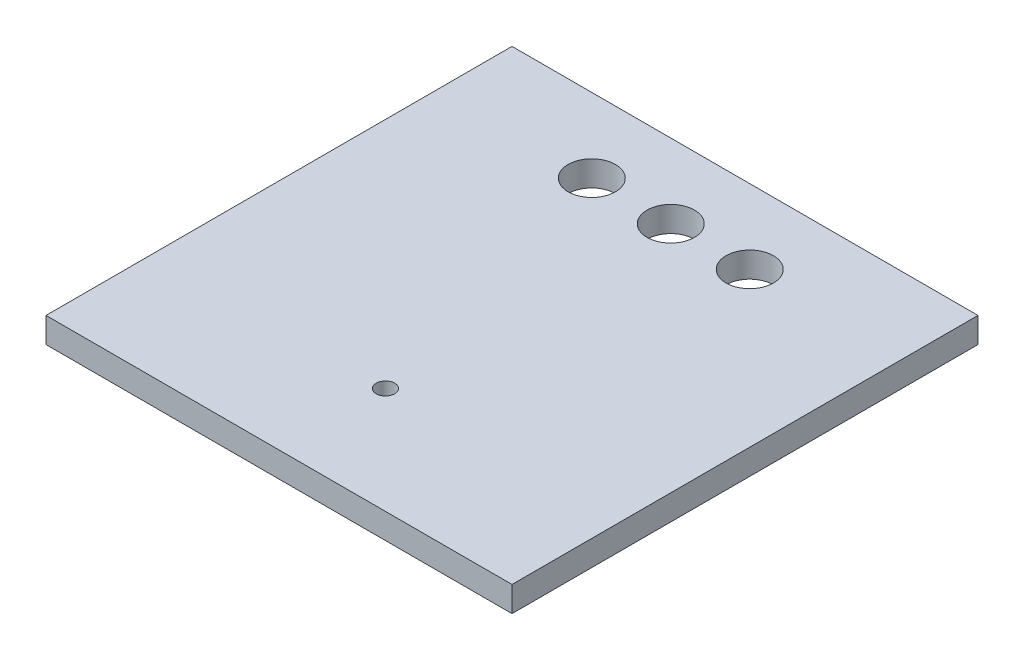
ISO-10303-21;
HEADER;
FILE_DESCRIPTION(('STEP AP214'),'2;1');
FILE_NAME('part.step','',(''),(''),'','','');
FILE_SCHEMA(('AUTOMOTIVE_DESIGN { 1 0 10303 214 1 1 1 1 }'));
ENDSEC;
DATA;
#1=APPLICATION_CONTEXT('core data for automotive mechanical design processes');
#2=APPLICATION_PROTOCOL_DEFINITION('international standard','automotive_design',2000,#1);
#3=PRODUCT_CONTEXT('',#1,'mechanical');
#4=PRODUCT('Part','Part','',(#3));
#5=PRODUCT_RELATED_PRODUCT_CATEGORY('part','',(#4));
#6=PRODUCT_DEFINITION_FORMATION('','',#4);
#7=PRODUCT_DEFINITION_CONTEXT('part definition',#1,'design');
#8=PRODUCT_DEFINITION('design','',#6,#7);
#9=PRODUCT_DEFINITION_SHAPE('','',#8);
#10=(LENGTH_UNIT() NAMED_UNIT(*) SI_UNIT(.MILLI.,.METRE.));
#11=(NAMED_UNIT(*) PLANE_ANGLE_UNIT() SI_UNIT($,.RADIAN.));
#12=(NAMED_UNIT(*) SI_UNIT($,.STERADIAN.) SOLID_ANGLE_UNIT());
#13=UNCERTAINTY_MEASURE_WITH_UNIT(LENGTH_MEASURE(1.E-05),#10,'distance_accuracy_value','');
#14=(GEOMETRIC_REPRESENTATION_CONTEXT(3) GLOBAL_UNCERTAINTY_ASSIGNED_CONTEXT((#13)) GLOBAL_UNIT_ASSIGNED_CONTEXT((#10,
#11,#12)) REPRESENTATION_CONTEXT('',''));
#15=CARTESIAN_POINT('',(0.,0.,0.));
#16=DIRECTION('',(0.,0.,1.));
#17=DIRECTION('',(1.,0.,0.));
#18=AXIS2_PLACEMENT_3D('',#15,#16,#17);
#19=CARTESIAN_POINT('',(7.49299999999999,0.8128,7.49300000000001));
#20=DIRECTION('',(-1.,0.,0.));
#21=DIRECTION('',(0.,0.,1.));
#22=AXIS2_PLACEMENT_3D('',#19,#20,#21);
#23=PLANE('',#22);
#24=DIRECTION('',(0.,0.,-1.));
#25=VECTOR('',#24,1.);
#26=CARTESIAN_POINT('',(7.49299999999999,0.,7.49300000000001));
#27=LINE('',#26,#25);
#28=CARTESIAN_POINT('',(7.49299999999999,0.,7.49300000000001));
#29=VERTEX_POINT('',#28);
#30=CARTESIAN_POINT('',(7.49299999999999,0.,-7.49299999999999));
#31=VERTEX_POINT('',#30);
#32=EDGE_CURVE('E98',#29,#31,#27,.T.);
#33=ORIENTED_EDGE('',*,*,#32,.T.);
#34=DIRECTION('',(0.,-1.,0.));
#35=VECTOR('',#34,1.);
#36=CARTESIAN_POINT('',(7.49299999999999,0.8128,-7.49299999999999));
#37=LINE('',#36,#35);
#38=CARTESIAN_POINT('',(7.49299999999999,0.8128,-7.49299999999999));
#39=VERTEX_POINT('',#38);
#40=EDGE_CURVE('E11',#39,#31,#37,.T.);
#41=ORIENTED_EDGE('',*,*,#40,.F.);
#42=DIRECTION('',(0.,0.,-1.));
#43=VECTOR('',#42,1.);
#44=CARTESIAN_POINT('',(7.49299999999999,0.8128,7.49300000000001));
#45=LINE('',#44,#43);
#46=CARTESIAN_POINT('',(7.49299999999999,0.8128,7.49300000000001));
#47=VERTEX_POINT('',#46);
#48=EDGE_CURVE('E85',#47,#39,#45,.T.);
#49=ORIENTED_EDGE('',*,*,#48,.F.);
#50=DIRECTION('',(0.,-1.,0.));
#51=VECTOR('',#50,1.);
#52=CARTESIAN_POINT('',(7.49299999999999,0.8128,7.49300000000001));
#53=LINE('',#52,#51);
#54=EDGE_CURVE('E94',#47,#29,#53,.T.);
#55=ORIENTED_EDGE('',*,*,#54,.T.);
#56=EDGE_LOOP('',(#33,#41,#49,#55));
#57=FACE_BOUND('',#56,.T.);
#58=ADVANCED_FACE('F32',(#57),#23,.F.);
#59=CARTESIAN_POINT('',(-7.49300000000001,0.8128,-7.49299999999999));
#60=DIRECTION('',(0.,0.,1.));
#61=DIRECTION('',(1.,0.,0.));
#62=AXIS2_PLACEMENT_3D('',#59,#60,#61);
#63=PLANE('',#62);
#64=DIRECTION('',(-1.,0.,0.));
#65=VECTOR('',#64,1.);
#66=CARTESIAN_POINT('',(-7.49300000000001,0.,-7.49299999999999));
#67=LINE('',#66,#65);
#68=CARTESIAN_POINT('',(-7.49300000000001,0.,-7.49299999999999));
#69=VERTEX_POINT('',#68);
#70=EDGE_CURVE('E89',#31,#69,#67,.T.);
#71=ORIENTED_EDGE('',*,*,#70,.T.);
#72=DIRECTION('',(0.,-1.,0.));
#73=VECTOR('',#72,1.);
#74=CARTESIAN_POINT('',(-7.49300000000001,0.8128,-7.49299999999999));
#75=LINE('',#74,#73);
#76=CARTESIAN_POINT('',(-7.49300000000001,0.8128,-7.49299999999999));
#77=VERTEX_POINT('',#76);
#78=EDGE_CURVE('E41',#77,#69,#75,.T.);
#79=ORIENTED_EDGE('',*,*,#78,.F.);
#80=DIRECTION('',(-1.,0.,0.));
#81=VECTOR('',#80,1.);
#82=CARTESIAN_POINT('',(-7.49300000000001,0.8128,-7.49299999999999));
#83=LINE('',#82,#81);
#84=EDGE_CURVE('E80',#39,#77,#83,.T.);
#85=ORIENTED_EDGE('',*,*,#84,.F.);
#86=ORIENTED_EDGE('',*,*,#40,.T.);
#87=EDGE_LOOP('',(#71,#79,#85,#86));
#88=FACE_BOUND('',#87,.T.);
#89=ADVANCED_FACE('F88',(#88),#63,.F.);
#90=CARTESIAN_POINT('',(-7.49300000000001,0.8128,7.49300000000001));
#91=DIRECTION('',(1.,0.,0.));
#92=DIRECTION('',(0.,0.,-1.));
#93=AXIS2_PLACEMENT_3D('',#90,#91,#92);
#94=PLANE('',#93);
#95=DIRECTION('',(0.,0.,1.));
#96=VECTOR('',#95,1.);
#97=CARTESIAN_POINT('',(-7.49300000000001,0.,7.49300000000001));
#98=LINE('',#97,#96);
#99=CARTESIAN_POINT('',(-7.49300000000001,0.,7.49300000000001));
#100=VERTEX_POINT('',#99);
#101=EDGE_CURVE('E67',#69,#100,#98,.T.);
#102=ORIENTED_EDGE('',*,*,#101,.T.);
#103=DIRECTION('',(0.,-1.,0.));
#104=VECTOR('',#103,1.);
#105=CARTESIAN_POINT('',(-7.49300000000001,0.8128,7.49300000000001));
#106=LINE('',#105,#104);
#107=CARTESIAN_POINT('',(-7.49300000000001,0.8128,7.49300000000001));
#108=VERTEX_POINT('',#107);
#109=EDGE_CURVE('E90',#108,#100,#106,.T.);
#110=ORIENTED_EDGE('',*,*,#109,.F.);
#111=DIRECTION('',(0.,0.,1.));
#112=VECTOR('',#111,1.);
#113=CARTESIAN_POINT('',(-7.49300000000001,0.8128,7.49300000000001));
#114=LINE('',#113,#112);
#115=EDGE_CURVE('E83',#77,#108,#114,.T.);
#116=ORIENTED_EDGE('',*,*,#115,.F.);
#117=ORIENTED_EDGE('',*,*,#78,.T.);
#118=EDGE_LOOP('',(#102,#110,#116,#117));
#119=FACE_BOUND('',#118,.T.);
#120=ADVANCED_FACE('F92',(#119),#94,.F.);
#121=CARTESIAN_POINT('',(-7.49300000000001,0.8128,7.49300000000001));
#122=DIRECTION('',(0.,0.,-1.));
#123=DIRECTION('',(-1.,0.,0.));
#124=AXIS2_PLACEMENT_3D('',#121,#122,#123);
#125=PLANE('',#124);
#126=DIRECTION('',(1.,0.,0.));
#127=VECTOR('',#126,1.);
#128=CARTESIAN_POINT('',(-7.49300000000001,0.,7.49300000000001));
#129=LINE('',#128,#127);
#130=EDGE_CURVE('E73',#100,#29,#129,.T.);
#131=ORIENTED_EDGE('',*,*,#130,.T.);
#132=ORIENTED_EDGE('',*,*,#54,.F.);
#133=DIRECTION('',(1.,0.,0.));
#134=VECTOR('',#133,1.);
#135=CARTESIAN_POINT('',(-7.49300000000001,0.8128,7.49300000000001));
#136=LINE('',#135,#134);
#137=EDGE_CURVE('E50',#108,#47,#136,.T.);
#138=ORIENTED_EDGE('',*,*,#137,.F.);
#139=ORIENTED_EDGE('',*,*,#109,.T.);
#140=EDGE_LOOP('',(#131,#132,#138,#139));
#141=FACE_BOUND('',#140,.T.);
#142=ADVANCED_FACE('F148',(#141),#125,.F.);
#143=CARTESIAN_POINT('',(0.,0.8128,0.));
#144=DIRECTION('',(0.,-1.,0.));
#145=DIRECTION('',(0.,0.,-1.));
#146=AXIS2_PLACEMENT_3D('',#143,#144,#145);
#147=PLANE('',#146);
#148=CARTESIAN_POINT('',(-2.54,0.8128,-5.10575447964992));
#149=DIRECTION('',(0.,-1.,0.));
#150=DIRECTION('',(0.,0.,-1.));
#151=AXIS2_PLACEMENT_3D('',#148,#149,#150);
#152=CIRCLE('',#151,0.762);
#153=CARTESIAN_POINT('',(-2.54,0.8128,-5.86775447964992));
#154=VERTEX_POINT('',#153);
#155=EDGE_CURVE('E101',#154,#154,#152,.T.);
#156=ORIENTED_EDGE('',*,*,#155,.T.);
#157=EDGE_LOOP('',(#156));
#158=FACE_BOUND('',#157,.T.);
#159=CARTESIAN_POINT('',(0.,0.8128,-5.10575447964992));
#160=DIRECTION('',(0.,-1.,0.));
#161=DIRECTION('',(0.,0.,-1.));
#162=AXIS2_PLACEMENT_3D('',#159,#160,#161);
#163=CIRCLE('',#162,0.762);
#164=CARTESIAN_POINT('',(0.,0.8128,-5.86775447964992));
#165=VERTEX_POINT('',#164);
#166=EDGE_CURVE('E116',#165,#165,#163,.T.);
#167=ORIENTED_EDGE('',*,*,#166,.T.);
#168=EDGE_LOOP('',(#167));
#169=FACE_BOUND('',#168,.T.);
#170=CARTESIAN_POINT('',(2.54,0.8128,-5.10575447964992));
#171=DIRECTION('',(0.,-1.,0.));
#172=DIRECTION('',(0.,0.,-1.));
#173=AXIS2_PLACEMENT_3D('',#170,#171,#172);
#174=CIRCLE('',#173,0.762);
#175=CARTESIAN_POINT('',(2.54,0.8128,-5.86775447964992));
#176=VERTEX_POINT('',#175);
#177=EDGE_CURVE('E113',#176,#176,#174,.T.);
#178=ORIENTED_EDGE('',*,*,#177,.T.);
#179=EDGE_LOOP('',(#178));
#180=FACE_BOUND('',#179,.T.);
#181=CARTESIAN_POINT('',(0.,0.8128,4.07020207700783));
#182=DIRECTION('',(0.,-1.,0.));
#183=DIRECTION('',(0.,0.,-1.));
#184=AXIS2_PLACEMENT_3D('',#181,#182,#183);
#185=CIRCLE('',#184,0.297244980669235);
#186=CARTESIAN_POINT('',(0.,0.8128,3.77295709633859));
#187=VERTEX_POINT('',#186);
#188=EDGE_CURVE('E110',#187,#187,#185,.T.);
#189=ORIENTED_EDGE('',*,*,#188,.T.);
#190=EDGE_LOOP('',(#189));
#191=FACE_BOUND('',#190,.T.);
#192=ORIENTED_EDGE('',*,*,#48,.T.);
#193=ORIENTED_EDGE('',*,*,#84,.T.);
#194=ORIENTED_EDGE('',*,*,#115,.T.);
#195=ORIENTED_EDGE('',*,*,#137,.T.);
#196=EDGE_LOOP('',(#192,#193,#194,#195));
#197=FACE_BOUND('',#196,.T.);
#198=ADVANCED_FACE('F81',(#158,#169,#180,#191,#197),#147,.F.);
#199=CARTESIAN_POINT('',(0.,0.,0.));
#200=DIRECTION('',(0.,-1.,0.));
#201=DIRECTION('',(0.,0.,-1.));
#202=AXIS2_PLACEMENT_3D('',#199,#200,#201);
#203=PLANE('',#202);
#204=CARTESIAN_POINT('',(-2.54,0.,-5.10575447964992));
#205=DIRECTION('',(0.,-1.,0.));
#206=DIRECTION('',(0.,0.,-1.));
#207=AXIS2_PLACEMENT_3D('',#204,#205,#206);
#208=CIRCLE('',#207,0.762);
#209=CARTESIAN_POINT('',(-2.54,0.,-5.86775447964992));
#210=VERTEX_POINT('',#209);
#211=EDGE_CURVE('E35',#210,#210,#208,.T.);
#212=ORIENTED_EDGE('',*,*,#211,.F.);
#213=EDGE_LOOP('',(#212));
#214=FACE_BOUND('',#213,.T.);
#215=CARTESIAN_POINT('',(0.,0.,-5.10575447964992));
#216=DIRECTION('',(0.,-1.,0.));
#217=DIRECTION('',(0.,0.,-1.));
#218=AXIS2_PLACEMENT_3D('',#215,#216,#217);
#219=CIRCLE('',#218,0.762);
#220=CARTESIAN_POINT('',(0.,0.,-5.86775447964992));
#221=VERTEX_POINT('',#220);
#222=EDGE_CURVE('E114',#221,#221,#219,.T.);
#223=ORIENTED_EDGE('',*,*,#222,.F.);
#224=EDGE_LOOP('',(#223));
#225=FACE_BOUND('',#224,.T.);
#226=CARTESIAN_POINT('',(2.54,0.,-5.10575447964992));
#227=DIRECTION('',(0.,-1.,0.));
#228=DIRECTION('',(0.,0.,-1.));
#229=AXIS2_PLACEMENT_3D('',#226,#227,#228);
#230=CIRCLE('',#229,0.762);
#231=CARTESIAN_POINT('',(2.54,0.,-5.86775447964992));
#232=VERTEX_POINT('',#231);
#233=EDGE_CURVE('E111',#232,#232,#230,.T.);
#234=ORIENTED_EDGE('',*,*,#233,.F.);
#235=EDGE_LOOP('',(#234));
#236=FACE_BOUND('',#235,.T.);
#237=CARTESIAN_POINT('',(0.,0.,4.07020207700783));
#238=DIRECTION('',(0.,-1.,0.));
#239=DIRECTION('',(0.,0.,-1.));
#240=AXIS2_PLACEMENT_3D('',#237,#238,#239);
#241=CIRCLE('',#240,0.297244980669235);
#242=CARTESIAN_POINT('',(0.,0.,3.77295709633859));
#243=VERTEX_POINT('',#242);
#244=EDGE_CURVE('E107',#243,#243,#241,.T.);
#245=ORIENTED_EDGE('',*,*,#244,.F.);
#246=EDGE_LOOP('',(#245));
#247=FACE_BOUND('',#246,.T.);
#248=ORIENTED_EDGE('',*,*,#32,.F.);
#249=ORIENTED_EDGE('',*,*,#130,.F.);
#250=ORIENTED_EDGE('',*,*,#101,.F.);
#251=ORIENTED_EDGE('',*,*,#70,.F.);
#252=EDGE_LOOP('',(#248,#249,#250,#251));
#253=FACE_BOUND('',#252,.T.);
#254=ADVANCED_FACE('F136',(#214,#225,#236,#247,#253),#203,.T.);
#255=CARTESIAN_POINT('',(0.,-5.8928,4.07020207700783));
#256=DIRECTION('',(0.,1.,0.));
#257=DIRECTION('',(0.,0.,1.));
#258=AXIS2_PLACEMENT_3D('',#255,#256,#257);
#259=CYLINDRICAL_SURFACE('',#258,0.297244980669235);
#260=ORIENTED_EDGE('',*,*,#244,.T.);
#261=EDGE_LOOP('',(#260));
#262=FACE_BOUND('',#261,.T.);
#263=ORIENTED_EDGE('',*,*,#188,.F.);
#264=EDGE_LOOP('',(#263));
#265=FACE_BOUND('',#264,.T.);
#266=ADVANCED_FACE('F139',(#262,#265),#259,.F.);
#267=CARTESIAN_POINT('',(2.54,-5.8928,-5.10575447964992));
#268=DIRECTION('',(0.,1.,0.));
#269=DIRECTION('',(0.,0.,1.));
#270=AXIS2_PLACEMENT_3D('',#267,#268,#269);
#271=CYLINDRICAL_SURFACE('',#270,0.762);
#272=ORIENTED_EDGE('',*,*,#233,.T.);
#273=EDGE_LOOP('',(#272));
#274=FACE_BOUND('',#273,.T.);
#275=ORIENTED_EDGE('',*,*,#177,.F.);
#276=EDGE_LOOP('',(#275));
#277=FACE_BOUND('',#276,.T.);
#278=ADVANCED_FACE('F192',(#274,#277),#271,.F.);
#279=CARTESIAN_POINT('',(0.,-5.8928,-5.10575447964992));
#280=DIRECTION('',(0.,1.,0.));
#281=DIRECTION('',(0.,0.,1.));
#282=AXIS2_PLACEMENT_3D('',#279,#280,#281);
#283=CYLINDRICAL_SURFACE('',#282,0.762);
#284=ORIENTED_EDGE('',*,*,#222,.T.);
#285=EDGE_LOOP('',(#284));
#286=FACE_BOUND('',#285,.T.);
#287=ORIENTED_EDGE('',*,*,#166,.F.);
#288=EDGE_LOOP('',(#287));
#289=FACE_BOUND('',#288,.T.);
#290=ADVANCED_FACE('F202',(#286,#289),#283,.F.);
#291=CARTESIAN_POINT('',(-2.54,-5.8928,-5.10575447964992));
#292=DIRECTION('',(0.,1.,0.));
#293=DIRECTION('',(0.,0.,1.));
#294=AXIS2_PLACEMENT_3D('',#291,#292,#293);
#295=CYLINDRICAL_SURFACE('',#294,0.762);
#296=ORIENTED_EDGE('',*,*,#211,.T.);
#297=EDGE_LOOP('',(#296));
#298=FACE_BOUND('',#297,.T.);
#299=ORIENTED_EDGE('',*,*,#155,.F.);
#300=EDGE_LOOP('',(#299));
#301=FACE_BOUND('',#300,.T.);
#302=ADVANCED_FACE('F133',(#298,#301),#295,.F.);
#303=CLOSED_SHELL('',(#58,#89,#120,#142,#198,#254,#266,#278,#290,#302));
#304=MANIFOLD_SOLID_BREP('B2',#303);
#305=ADVANCED_BREP_SHAPE_REPRESENTATION('',(#18,#304),#14);
#306=SHAPE_DEFINITION_REPRESENTATION(#9,#305);
ENDSEC;
END-ISO-10303-21;
